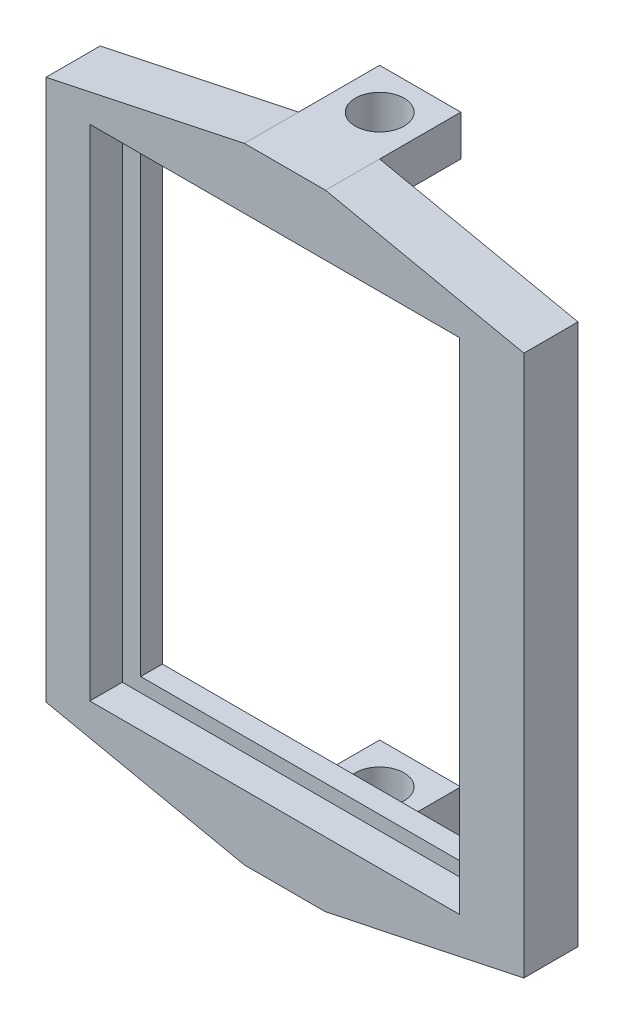
ISO-10303-21;
HEADER;
FILE_DESCRIPTION(('STEP AP214'),'2;1');
FILE_NAME('part.step','',(''),(''),'','','');
FILE_SCHEMA(('AUTOMOTIVE_DESIGN { 1 0 10303 214 1 1 1 1 }'));
ENDSEC;
DATA;
#1=APPLICATION_CONTEXT('core data for automotive mechanical design processes');
#2=APPLICATION_PROTOCOL_DEFINITION('international standard','automotive_design',2000,#1);
#3=PRODUCT_CONTEXT('',#1,'mechanical');
#4=PRODUCT('Part','Part','',(#3));
#5=PRODUCT_RELATED_PRODUCT_CATEGORY('part','',(#4));
#6=PRODUCT_DEFINITION_FORMATION('','',#4);
#7=PRODUCT_DEFINITION_CONTEXT('part definition',#1,'design');
#8=PRODUCT_DEFINITION('design','',#6,#7);
#9=PRODUCT_DEFINITION_SHAPE('','',#8);
#10=(LENGTH_UNIT() NAMED_UNIT(*) SI_UNIT(.MILLI.,.METRE.));
#11=(NAMED_UNIT(*) PLANE_ANGLE_UNIT() SI_UNIT($,.RADIAN.));
#12=(NAMED_UNIT(*) SI_UNIT($,.STERADIAN.) SOLID_ANGLE_UNIT());
#13=UNCERTAINTY_MEASURE_WITH_UNIT(LENGTH_MEASURE(1.E-05),#10,'distance_accuracy_value','');
#14=(GEOMETRIC_REPRESENTATION_CONTEXT(3) GLOBAL_UNCERTAINTY_ASSIGNED_CONTEXT((#13)) GLOBAL_UNIT_ASSIGNED_CONTEXT((#10,
#11,#12)) REPRESENTATION_CONTEXT('',''));
#15=CARTESIAN_POINT('',(0.,0.,0.));
#16=DIRECTION('',(0.,0.,1.));
#17=DIRECTION('',(1.,0.,0.));
#18=AXIS2_PLACEMENT_3D('',#15,#16,#17);
#19=CARTESIAN_POINT('',(10.5819434615359,28.3481904822226,7.5));
#20=DIRECTION('',(1.,0.,0.));
#21=DIRECTION('',(0.,0.,-1.));
#22=AXIS2_PLACEMENT_3D('',#19,#20,#21);
#23=PLANE('',#22);
#24=DIRECTION('',(0.,-1.,0.));
#25=VECTOR('',#24,1.);
#26=CARTESIAN_POINT('',(10.5819434615359,28.3481904822226,0.));
#27=LINE('',#26,#25);
#28=CARTESIAN_POINT('',(10.5819434615359,28.3481904822226,0.));
#29=VERTEX_POINT('',#28);
#30=CARTESIAN_POINT('',(10.5819434615359,24.5981904822226,0.));
#31=VERTEX_POINT('',#30);
#32=EDGE_CURVE('E105',#29,#31,#27,.T.);
#33=ORIENTED_EDGE('',*,*,#32,.F.);
#34=DIRECTION('',(0.,0.,-1.));
#35=VECTOR('',#34,1.);
#36=CARTESIAN_POINT('',(10.5819434615359,28.3481904822226,7.5));
#37=LINE('',#36,#35);
#38=CARTESIAN_POINT('',(10.5819434615359,28.3481904822226,7.5));
#39=VERTEX_POINT('',#38);
#40=EDGE_CURVE('E11',#39,#29,#37,.T.);
#41=ORIENTED_EDGE('',*,*,#40,.F.);
#42=DIRECTION('',(0.,-1.,0.));
#43=VECTOR('',#42,1.);
#44=CARTESIAN_POINT('',(10.5819434615359,28.3481904822226,7.5));
#45=LINE('',#44,#43);
#46=CARTESIAN_POINT('',(10.5819434615359,24.5981904822226,7.5));
#47=VERTEX_POINT('',#46);
#48=EDGE_CURVE('E92',#39,#47,#45,.T.);
#49=ORIENTED_EDGE('',*,*,#48,.T.);
#50=DIRECTION('',(0.,0.,-1.));
#51=VECTOR('',#50,1.);
#52=CARTESIAN_POINT('',(10.5819434615359,24.5981904822226,7.5));
#53=LINE('',#52,#51);
#54=EDGE_CURVE('E109',#47,#31,#53,.T.);
#55=ORIENTED_EDGE('',*,*,#54,.T.);
#56=EDGE_LOOP('',(#33,#41,#49,#55));
#57=FACE_BOUND('',#56,.T.);
#58=ADVANCED_FACE('F39',(#57),#23,.T.);
#59=CARTESIAN_POINT('',(10.5819434615359,28.3481904822226,7.5));
#60=DIRECTION('',(0.,-1.,0.));
#61=DIRECTION('',(0.,0.,-1.));
#62=AXIS2_PLACEMENT_3D('',#59,#60,#61);
#63=PLANE('',#62);
#64=CARTESIAN_POINT('',(6.83194346153586,28.3481904822226,3.75));
#65=DIRECTION('',(0.,1.,0.));
#66=DIRECTION('',(0.,0.,1.));
#67=AXIS2_PLACEMENT_3D('',#64,#65,#66);
#68=CIRCLE('',#67,2.25);
#69=CARTESIAN_POINT('',(6.83194346153586,28.3481904822226,6.));
#70=VERTEX_POINT('',#69);
#71=EDGE_CURVE('E119',#70,#70,#68,.T.);
#72=ORIENTED_EDGE('',*,*,#71,.F.);
#73=EDGE_LOOP('',(#72));
#74=FACE_BOUND('',#73,.T.);
#75=DIRECTION('',(-1.,0.,0.));
#76=VECTOR('',#75,1.);
#77=CARTESIAN_POINT('',(10.5819434615359,28.3481904822226,0.));
#78=LINE('',#77,#76);
#79=CARTESIAN_POINT('',(3.08194346153586,28.3481904822226,0.));
#80=VERTEX_POINT('',#79);
#81=EDGE_CURVE('E81',#29,#80,#78,.T.);
#82=ORIENTED_EDGE('',*,*,#81,.T.);
#83=DIRECTION('',(0.,0.,-1.));
#84=VECTOR('',#83,1.);
#85=CARTESIAN_POINT('',(3.08194346153586,28.3481904822226,7.5));
#86=LINE('',#85,#84);
#87=CARTESIAN_POINT('',(3.08194346153586,28.3481904822226,7.5));
#88=VERTEX_POINT('',#87);
#89=EDGE_CURVE('E47',#88,#80,#86,.T.);
#90=ORIENTED_EDGE('',*,*,#89,.F.);
#91=DIRECTION('',(0.,0.,-1.));
#92=VECTOR('',#91,1.);
#93=CARTESIAN_POINT('',(3.08194346153586,28.3481904822226,9.5));
#94=LINE('',#93,#92);
#95=CARTESIAN_POINT('',(3.08194346153586,28.3481904822226,12.5));
#96=VERTEX_POINT('',#95);
#97=EDGE_CURVE('E127',#96,#88,#94,.T.);
#98=ORIENTED_EDGE('',*,*,#97,.F.);
#99=DIRECTION('',(-1.,0.,0.));
#100=VECTOR('',#99,1.);
#101=CARTESIAN_POINT('',(3.08194346153586,28.3481904822226,12.5));
#102=LINE('',#101,#100);
#103=CARTESIAN_POINT('',(10.5819434615359,28.3481904822226,12.5));
#104=VERTEX_POINT('',#103);
#105=EDGE_CURVE('E147',#104,#96,#102,.T.);
#106=ORIENTED_EDGE('',*,*,#105,.F.);
#107=DIRECTION('',(0.,0.,-1.));
#108=VECTOR('',#107,1.);
#109=CARTESIAN_POINT('',(10.5819434615359,28.3481904822226,9.5));
#110=LINE('',#109,#108);
#111=EDGE_CURVE('E123',#104,#39,#110,.T.);
#112=ORIENTED_EDGE('',*,*,#111,.T.);
#113=ORIENTED_EDGE('',*,*,#40,.T.);
#114=EDGE_LOOP('',(#82,#90,#98,#106,#112,#113));
#115=FACE_BOUND('',#114,.T.);
#116=ADVANCED_FACE('F83',(#74,#115),#63,.F.);
#117=CARTESIAN_POINT('',(3.08194346153586,28.3481904822226,7.5));
#118=DIRECTION('',(1.,0.,0.));
#119=DIRECTION('',(0.,1.,0.));
#120=AXIS2_PLACEMENT_3D('',#117,#118,#119);
#121=PLANE('',#120);
#122=DIRECTION('',(0.,-1.,0.));
#123=VECTOR('',#122,1.);
#124=CARTESIAN_POINT('',(3.08194346153586,28.3481904822226,0.));
#125=LINE('',#124,#123);
#126=CARTESIAN_POINT('',(3.08194346153586,24.5981904822226,0.));
#127=VERTEX_POINT('',#126);
#128=EDGE_CURVE('E93',#80,#127,#125,.T.);
#129=ORIENTED_EDGE('',*,*,#128,.T.);
#130=DIRECTION('',(0.,0.,-1.));
#131=VECTOR('',#130,1.);
#132=CARTESIAN_POINT('',(3.08194346153586,24.5981904822226,7.5));
#133=LINE('',#132,#131);
#134=CARTESIAN_POINT('',(3.08194346153586,24.5981904822226,7.5));
#135=VERTEX_POINT('',#134);
#136=EDGE_CURVE('E99',#135,#127,#133,.T.);
#137=ORIENTED_EDGE('',*,*,#136,.F.);
#138=DIRECTION('',(0.,-1.,0.));
#139=VECTOR('',#138,1.);
#140=CARTESIAN_POINT('',(3.08194346153586,28.3481904822226,7.5));
#141=LINE('',#140,#139);
#142=EDGE_CURVE('E64',#88,#135,#141,.T.);
#143=ORIENTED_EDGE('',*,*,#142,.F.);
#144=ORIENTED_EDGE('',*,*,#89,.T.);
#145=EDGE_LOOP('',(#129,#137,#143,#144));
#146=FACE_BOUND('',#145,.T.);
#147=ADVANCED_FACE('F97',(#146),#121,.F.);
#148=CARTESIAN_POINT('',(10.5819434615359,24.5981904822226,7.5));
#149=DIRECTION('',(0.,-1.,0.));
#150=DIRECTION('',(0.,0.,-1.));
#151=AXIS2_PLACEMENT_3D('',#148,#149,#150);
#152=PLANE('',#151);
#153=CARTESIAN_POINT('',(6.83194346153586,24.5981904822226,3.75));
#154=DIRECTION('',(0.,-1.,0.));
#155=DIRECTION('',(0.,0.,-1.));
#156=AXIS2_PLACEMENT_3D('',#153,#154,#155);
#157=CIRCLE('',#156,2.25);
#158=CARTESIAN_POINT('',(6.83194346153586,24.5981904822226,1.5));
#159=VERTEX_POINT('',#158);
#160=EDGE_CURVE('E42',#159,#159,#157,.T.);
#161=ORIENTED_EDGE('',*,*,#160,.F.);
#162=EDGE_LOOP('',(#161));
#163=FACE_BOUND('',#162,.T.);
#164=DIRECTION('',(-1.,0.,0.));
#165=VECTOR('',#164,1.);
#166=CARTESIAN_POINT('',(10.5819434615359,24.5981904822226,0.));
#167=LINE('',#166,#165);
#168=EDGE_CURVE('E103',#31,#127,#167,.T.);
#169=ORIENTED_EDGE('',*,*,#168,.F.);
#170=ORIENTED_EDGE('',*,*,#54,.F.);
#171=DIRECTION('',(-1.,0.,0.));
#172=VECTOR('',#171,1.);
#173=CARTESIAN_POINT('',(10.5819434615359,24.5981904822226,7.5));
#174=LINE('',#173,#172);
#175=EDGE_CURVE('E113',#47,#135,#174,.T.);
#176=ORIENTED_EDGE('',*,*,#175,.T.);
#177=ORIENTED_EDGE('',*,*,#136,.T.);
#178=EDGE_LOOP('',(#169,#170,#176,#177));
#179=FACE_BOUND('',#178,.T.);
#180=ADVANCED_FACE('F464',(#163,#179),#152,.T.);
#181=CARTESIAN_POINT('',(0.,0.,0.));
#182=DIRECTION('',(0.,0.,-1.));
#183=DIRECTION('',(-1.,0.,0.));
#184=AXIS2_PLACEMENT_3D('',#181,#182,#183);
#185=PLANE('',#184);
#186=ORIENTED_EDGE('',*,*,#32,.T.);
#187=ORIENTED_EDGE('',*,*,#168,.T.);
#188=ORIENTED_EDGE('',*,*,#128,.F.);
#189=ORIENTED_EDGE('',*,*,#81,.F.);
#190=EDGE_LOOP('',(#186,#187,#188,#189));
#191=FACE_BOUND('',#190,.T.);
#192=ADVANCED_FACE('F101',(#191),#185,.T.);
#193=CARTESIAN_POINT('',(6.83194346153586,-29.389582515065,3.75));
#194=DIRECTION('',(0.,1.,0.));
#195=DIRECTION('',(0.,0.,1.));
#196=AXIS2_PLACEMENT_3D('',#193,#194,#195);
#197=CYLINDRICAL_SURFACE('',#196,2.25);
#198=ORIENTED_EDGE('',*,*,#160,.T.);
#199=EDGE_LOOP('',(#198));
#200=FACE_BOUND('',#199,.T.);
#201=ORIENTED_EDGE('',*,*,#71,.T.);
#202=EDGE_LOOP('',(#201));
#203=FACE_BOUND('',#202,.T.);
#204=ADVANCED_FACE('F474',(#200,#203),#197,.F.);
#205=CARTESIAN_POINT('',(0.,0.,7.5));
#206=DIRECTION('',(0.,0.,-1.));
#207=DIRECTION('',(-1.,0.,0.));
#208=AXIS2_PLACEMENT_3D('',#205,#206,#207);
#209=PLANE('',#208);
#210=DIRECTION('',(0.,1.,0.));
#211=VECTOR('',#210,1.);
#212=CARTESIAN_POINT('',(3.0819434615123,-29.389582515065,7.5));
#213=LINE('',#212,#211);
#214=CARTESIAN_POINT('',(3.0819434615123,-29.389582515065,7.5));
#215=VERTEX_POINT('',#214);
#216=CARTESIAN_POINT('',(3.0819434615123,-25.639582515065,7.5));
#217=VERTEX_POINT('',#216);
#218=EDGE_CURVE('E272',#215,#217,#213,.T.);
#219=ORIENTED_EDGE('',*,*,#218,.F.);
#220=DIRECTION('',(0.978443327443816,-0.206515507845474,0.));
#221=VECTOR('',#220,1.);
#222=CARTESIAN_POINT('',(-15.2430565384641,-25.5218095177774,7.5));
#223=LINE('',#222,#221);
#224=CARTESIAN_POINT('',(-15.2430565384641,-25.5218095177774,7.5));
#225=VERTEX_POINT('',#224);
#226=EDGE_CURVE('E168',#225,#215,#223,.T.);
#227=ORIENTED_EDGE('',*,*,#226,.F.);
#228=DIRECTION('',(0.,-1.,0.));
#229=VECTOR('',#228,1.);
#230=CARTESIAN_POINT('',(-15.2430565384641,24.4781904822226,7.5));
#231=LINE('',#230,#229);
#232=CARTESIAN_POINT('',(-15.2430565384641,24.4781904822226,7.5));
#233=VERTEX_POINT('',#232);
#234=EDGE_CURVE('E159',#233,#225,#231,.T.);
#235=ORIENTED_EDGE('',*,*,#234,.F.);
#236=DIRECTION('',(-0.978419294343803,-0.206629340742729,0.));
#237=VECTOR('',#236,1.);
#238=CARTESIAN_POINT('',(-15.2430565384641,24.4781904822226,7.5));
#239=LINE('',#238,#237);
#240=EDGE_CURVE('E155',#88,#233,#239,.T.);
#241=ORIENTED_EDGE('',*,*,#240,.F.);
#242=ORIENTED_EDGE('',*,*,#142,.T.);
#243=ORIENTED_EDGE('',*,*,#175,.F.);
#244=ORIENTED_EDGE('',*,*,#48,.F.);
#245=DIRECTION('',(-0.978419294343695,0.206629340743238,0.));
#246=VECTOR('',#245,1.);
#247=CARTESIAN_POINT('',(10.5819434615359,28.3481904822226,7.5));
#248=LINE('',#247,#246);
#249=CARTESIAN_POINT('',(28.9069434614887,24.4781904822226,7.5));
#250=VERTEX_POINT('',#249);
#251=EDGE_CURVE('E140',#250,#39,#248,.T.);
#252=ORIENTED_EDGE('',*,*,#251,.F.);
#253=DIRECTION('',(0.,1.,0.));
#254=VECTOR('',#253,1.);
#255=CARTESIAN_POINT('',(28.9069434614887,24.4781904822226,7.5));
#256=LINE('',#255,#254);
#257=CARTESIAN_POINT('',(28.9069434614887,-25.5218095177774,7.5));
#258=VERTEX_POINT('',#257);
#259=EDGE_CURVE('E174',#258,#250,#256,.T.);
#260=ORIENTED_EDGE('',*,*,#259,.F.);
#261=DIRECTION('',(0.978443327443816,0.206515507845474,0.));
#262=VECTOR('',#261,1.);
#263=CARTESIAN_POINT('',(10.5819434615123,-29.389582515065,7.5));
#264=LINE('',#263,#262);
#265=CARTESIAN_POINT('',(10.5819434615123,-29.389582515065,7.5));
#266=VERTEX_POINT('',#265);
#267=EDGE_CURVE('E171',#266,#258,#264,.T.);
#268=ORIENTED_EDGE('',*,*,#267,.F.);
#269=DIRECTION('',(0.,1.,0.));
#270=VECTOR('',#269,1.);
#271=CARTESIAN_POINT('',(10.5819434615123,-29.389582515065,7.5));
#272=LINE('',#271,#270);
#273=CARTESIAN_POINT('',(10.5819434615123,-25.639582515065,7.5));
#274=VERTEX_POINT('',#273);
#275=EDGE_CURVE('E258',#266,#274,#272,.T.);
#276=ORIENTED_EDGE('',*,*,#275,.T.);
#277=DIRECTION('',(1.,0.,0.));
#278=VECTOR('',#277,1.);
#279=CARTESIAN_POINT('',(3.0819434615123,-25.639582515065,7.5));
#280=LINE('',#279,#278);
#281=EDGE_CURVE('E284',#217,#274,#280,.T.);
#282=ORIENTED_EDGE('',*,*,#281,.F.);
#283=EDGE_LOOP('',(#219,#227,#235,#241,#242,#243,#244,#252,#260,#268,#276,#282));
#284=FACE_BOUND('',#283,.T.);
#285=DIRECTION('',(0.,1.,0.));
#286=VECTOR('',#285,1.);
#287=CARTESIAN_POINT('',(22.2069434615354,21.2481904822223,7.5));
#288=LINE('',#287,#286);
#289=CARTESIAN_POINT('',(22.2069434615354,-22.1018095177777,7.5));
#290=VERTEX_POINT('',#289);
#291=CARTESIAN_POINT('',(22.2069434615354,21.2481904822223,7.5));
#292=VERTEX_POINT('',#291);
#293=EDGE_CURVE('E295',#290,#292,#288,.T.);
#294=ORIENTED_EDGE('',*,*,#293,.T.);
#295=DIRECTION('',(-1.,0.,0.));
#296=VECTOR('',#295,1.);
#297=CARTESIAN_POINT('',(22.2069434615354,21.2481904822223,7.5));
#298=LINE('',#297,#296);
#299=CARTESIAN_POINT('',(-9.49305653846411,21.2481904822223,7.5));
#300=VERTEX_POINT('',#299);
#301=EDGE_CURVE('E281',#292,#300,#298,.T.);
#302=ORIENTED_EDGE('',*,*,#301,.T.);
#303=DIRECTION('',(0.,-1.,0.));
#304=VECTOR('',#303,1.);
#305=CARTESIAN_POINT('',(-9.49305653846411,21.2481904822223,7.5));
#306=LINE('',#305,#304);
#307=CARTESIAN_POINT('',(-9.49305653846367,-22.1018095177777,7.5));
#308=VERTEX_POINT('',#307);
#309=EDGE_CURVE('E307',#300,#308,#306,.T.);
#310=ORIENTED_EDGE('',*,*,#309,.T.);
#311=DIRECTION('',(1.,0.,0.));
#312=VECTOR('',#311,1.);
#313=CARTESIAN_POINT('',(22.2069434615354,-22.1018095177777,7.5));
#314=LINE('',#313,#312);
#315=EDGE_CURVE('E310',#308,#290,#314,.T.);
#316=ORIENTED_EDGE('',*,*,#315,.T.);
#317=EDGE_LOOP('',(#294,#302,#310,#316));
#318=FACE_BOUND('',#317,.T.);
#319=ADVANCED_FACE('F135',(#284,#318),#209,.T.);
#320=CARTESIAN_POINT('',(0.,0.,9.5));
#321=DIRECTION('',(0.,0.,-1.));
#322=DIRECTION('',(-1.,0.,0.));
#323=AXIS2_PLACEMENT_3D('',#320,#321,#322);
#324=PLANE('',#323);
#325=DIRECTION('',(-1.,0.,0.));
#326=VECTOR('',#325,1.);
#327=CARTESIAN_POINT('',(-11.1930565384647,22.7431904822222,9.5));
#328=LINE('',#327,#326);
#329=CARTESIAN_POINT('',(22.9569434615353,22.7431904822223,9.5));
#330=VERTEX_POINT('',#329);
#331=CARTESIAN_POINT('',(-11.1930565384647,22.7431904822222,9.5));
#332=VERTEX_POINT('',#331);
#333=EDGE_CURVE('E435',#330,#332,#328,.T.);
#334=ORIENTED_EDGE('',*,*,#333,.T.);
#335=DIRECTION('',(0.,-1.,0.));
#336=VECTOR('',#335,1.);
#337=CARTESIAN_POINT('',(-11.1930565384646,-23.4068095177778,9.5));
#338=LINE('',#337,#336);
#339=CARTESIAN_POINT('',(-11.1930565384646,-23.4068095177778,9.5));
#340=VERTEX_POINT('',#339);
#341=EDGE_CURVE('E55',#332,#340,#338,.T.);
#342=ORIENTED_EDGE('',*,*,#341,.T.);
#343=DIRECTION('',(1.,0.,0.));
#344=VECTOR('',#343,1.);
#345=CARTESIAN_POINT('',(-11.1930565384646,-23.4068095177778,9.5));
#346=LINE('',#345,#344);
#347=CARTESIAN_POINT('',(22.9569434615354,-23.4068095177777,9.5));
#348=VERTEX_POINT('',#347);
#349=EDGE_CURVE('E432',#340,#348,#346,.T.);
#350=ORIENTED_EDGE('',*,*,#349,.T.);
#351=DIRECTION('',(0.,1.,0.));
#352=VECTOR('',#351,1.);
#353=CARTESIAN_POINT('',(22.9569434615354,-23.4068095177777,9.5));
#354=LINE('',#353,#352);
#355=EDGE_CURVE('E423',#348,#330,#354,.T.);
#356=ORIENTED_EDGE('',*,*,#355,.T.);
#357=EDGE_LOOP('',(#334,#342,#350,#356));
#358=FACE_BOUND('',#357,.T.);
#359=DIRECTION('',(-1.,0.,0.));
#360=VECTOR('',#359,1.);
#361=CARTESIAN_POINT('',(22.2069434615354,21.2481904822223,9.5));
#362=LINE('',#361,#360);
#363=CARTESIAN_POINT('',(22.2069434615354,21.2481904822223,9.5));
#364=VERTEX_POINT('',#363);
#365=CARTESIAN_POINT('',(-9.49305653846411,21.2481904822223,9.5));
#366=VERTEX_POINT('',#365);
#367=EDGE_CURVE('E291',#364,#366,#362,.T.);
#368=ORIENTED_EDGE('',*,*,#367,.F.);
#369=DIRECTION('',(0.,1.,0.));
#370=VECTOR('',#369,1.);
#371=CARTESIAN_POINT('',(22.2069434615354,21.2481904822223,9.5));
#372=LINE('',#371,#370);
#373=CARTESIAN_POINT('',(22.2069434615354,-22.1018095177777,9.5));
#374=VERTEX_POINT('',#373);
#375=EDGE_CURVE('E301',#374,#364,#372,.T.);
#376=ORIENTED_EDGE('',*,*,#375,.F.);
#377=DIRECTION('',(1.,0.,0.));
#378=VECTOR('',#377,1.);
#379=CARTESIAN_POINT('',(22.2069434615354,-22.1018095177777,9.5));
#380=LINE('',#379,#378);
#381=CARTESIAN_POINT('',(-9.49305653846367,-22.1018095177777,9.5));
#382=VERTEX_POINT('',#381);
#383=EDGE_CURVE('E298',#382,#374,#380,.T.);
#384=ORIENTED_EDGE('',*,*,#383,.F.);
#385=DIRECTION('',(0.,-1.,0.));
#386=VECTOR('',#385,1.);
#387=CARTESIAN_POINT('',(-9.49305653846411,21.2481904822223,9.5));
#388=LINE('',#387,#386);
#389=EDGE_CURVE('E294',#366,#382,#388,.T.);
#390=ORIENTED_EDGE('',*,*,#389,.F.);
#391=EDGE_LOOP('',(#368,#376,#384,#390));
#392=FACE_BOUND('',#391,.T.);
#393=ADVANCED_FACE('F351',(#358,#392),#324,.F.);
#394=CARTESIAN_POINT('',(10.5819434615359,28.3481904822226,9.5));
#395=DIRECTION('',(-0.206629340743238,-0.978419294343695,0.));
#396=DIRECTION('',(0.978419294343696,-0.206629340743238,0.));
#397=AXIS2_PLACEMENT_3D('',#394,#395,#396);
#398=PLANE('',#397);
#399=ORIENTED_EDGE('',*,*,#251,.T.);
#400=ORIENTED_EDGE('',*,*,#111,.F.);
#401=DIRECTION('',(-0.978419294343695,0.206629340743238,0.));
#402=VECTOR('',#401,1.);
#403=CARTESIAN_POINT('',(10.5819434615359,28.3481904822226,12.5));
#404=LINE('',#403,#402);
#405=CARTESIAN_POINT('',(28.9069434614887,24.4781904822226,12.5));
#406=VERTEX_POINT('',#405);
#407=EDGE_CURVE('E247',#406,#104,#404,.T.);
#408=ORIENTED_EDGE('',*,*,#407,.F.);
#409=DIRECTION('',(0.,0.,-1.));
#410=VECTOR('',#409,1.);
#411=CARTESIAN_POINT('',(28.9069434614887,24.4781904822226,9.5));
#412=LINE('',#411,#410);
#413=EDGE_CURVE('E154',#406,#250,#412,.T.);
#414=ORIENTED_EDGE('',*,*,#413,.T.);
#415=EDGE_LOOP('',(#399,#400,#408,#414));
#416=FACE_BOUND('',#415,.T.);
#417=ADVANCED_FACE('F152',(#416),#398,.F.);
#418=CARTESIAN_POINT('',(-15.2430565384641,24.4781904822226,9.5));
#419=DIRECTION('',(0.206629340742729,-0.978419294343803,0.));
#420=DIRECTION('',(0.978419294343803,0.206629340742729,0.));
#421=AXIS2_PLACEMENT_3D('',#418,#419,#420);
#422=PLANE('',#421);
#423=ORIENTED_EDGE('',*,*,#240,.T.);
#424=DIRECTION('',(0.,0.,-1.));
#425=VECTOR('',#424,1.);
#426=CARTESIAN_POINT('',(-15.2430565384641,24.4781904822226,9.5));
#427=LINE('',#426,#425);
#428=CARTESIAN_POINT('',(-15.2430565384641,24.4781904822226,12.5));
#429=VERTEX_POINT('',#428);
#430=EDGE_CURVE('E190',#429,#233,#427,.T.);
#431=ORIENTED_EDGE('',*,*,#430,.F.);
#432=DIRECTION('',(-0.978419294343803,-0.206629340742729,0.));
#433=VECTOR('',#432,1.);
#434=CARTESIAN_POINT('',(-15.2430565384641,24.4781904822226,12.5));
#435=LINE('',#434,#433);
#436=EDGE_CURVE('E200',#96,#429,#435,.T.);
#437=ORIENTED_EDGE('',*,*,#436,.F.);
#438=ORIENTED_EDGE('',*,*,#97,.T.);
#439=EDGE_LOOP('',(#423,#431,#437,#438));
#440=FACE_BOUND('',#439,.T.);
#441=ADVANCED_FACE('F195',(#440),#422,.F.);
#442=CARTESIAN_POINT('',(-15.2430565384641,24.4781904822226,9.5));
#443=DIRECTION('',(1.,0.,0.));
#444=DIRECTION('',(0.,0.,-1.));
#445=AXIS2_PLACEMENT_3D('',#442,#443,#444);
#446=PLANE('',#445);
#447=ORIENTED_EDGE('',*,*,#234,.T.);
#448=DIRECTION('',(0.,0.,-1.));
#449=VECTOR('',#448,1.);
#450=CARTESIAN_POINT('',(-15.2430565384641,-25.5218095177774,9.5));
#451=LINE('',#450,#449);
#452=CARTESIAN_POINT('',(-15.2430565384641,-25.5218095177774,12.5));
#453=VERTEX_POINT('',#452);
#454=EDGE_CURVE('E187',#453,#225,#451,.T.);
#455=ORIENTED_EDGE('',*,*,#454,.F.);
#456=DIRECTION('',(0.,-1.,0.));
#457=VECTOR('',#456,1.);
#458=CARTESIAN_POINT('',(-15.2430565384641,-25.5218095177774,12.5));
#459=LINE('',#458,#457);
#460=EDGE_CURVE('E228',#429,#453,#459,.T.);
#461=ORIENTED_EDGE('',*,*,#460,.F.);
#462=ORIENTED_EDGE('',*,*,#430,.T.);
#463=EDGE_LOOP('',(#447,#455,#461,#462));
#464=FACE_BOUND('',#463,.T.);
#465=ADVANCED_FACE('F208',(#464),#446,.F.);
#466=CARTESIAN_POINT('',(-15.2430565384641,-25.5218095177774,9.5));
#467=DIRECTION('',(0.206515507845474,0.978443327443816,0.));
#468=DIRECTION('',(-0.978443327443816,0.206515507845474,0.));
#469=AXIS2_PLACEMENT_3D('',#466,#467,#468);
#470=PLANE('',#469);
#471=ORIENTED_EDGE('',*,*,#226,.T.);
#472=DIRECTION('',(0.,0.,-1.));
#473=VECTOR('',#472,1.);
#474=CARTESIAN_POINT('',(3.0819434615123,-29.389582515065,9.5));
#475=LINE('',#474,#473);
#476=CARTESIAN_POINT('',(3.0819434615123,-29.389582515065,12.5));
#477=VERTEX_POINT('',#476);
#478=EDGE_CURVE('E184',#477,#215,#475,.T.);
#479=ORIENTED_EDGE('',*,*,#478,.F.);
#480=DIRECTION('',(0.978443327443816,-0.206515507845474,0.));
#481=VECTOR('',#480,1.);
#482=CARTESIAN_POINT('',(3.0819434615123,-29.389582515065,12.5));
#483=LINE('',#482,#481);
#484=EDGE_CURVE('E219',#453,#477,#483,.T.);
#485=ORIENTED_EDGE('',*,*,#484,.F.);
#486=ORIENTED_EDGE('',*,*,#454,.T.);
#487=EDGE_LOOP('',(#471,#479,#485,#486));
#488=FACE_BOUND('',#487,.T.);
#489=ADVANCED_FACE('F215',(#488),#470,.F.);
#490=CARTESIAN_POINT('',(3.0819434615123,-29.389582515065,9.5));
#491=DIRECTION('',(0.,1.,0.));
#492=DIRECTION('',(0.,0.,1.));
#493=AXIS2_PLACEMENT_3D('',#490,#491,#492);
#494=PLANE('',#493);
#495=ORIENTED_EDGE('',*,*,#478,.T.);
#496=DIRECTION('',(0.,0.,-1.));
#497=VECTOR('',#496,1.);
#498=CARTESIAN_POINT('',(3.0819434615123,-29.389582515065,7.5));
#499=LINE('',#498,#497);
#500=CARTESIAN_POINT('',(3.0819434615123,-29.389582515065,0.));
#501=VERTEX_POINT('',#500);
#502=EDGE_CURVE('E265',#215,#501,#499,.T.);
#503=ORIENTED_EDGE('',*,*,#502,.T.);
#504=DIRECTION('',(1.,0.,0.));
#505=VECTOR('',#504,1.);
#506=CARTESIAN_POINT('',(3.0819434615123,-29.389582515065,0.));
#507=LINE('',#506,#505);
#508=CARTESIAN_POINT('',(10.5819434615123,-29.389582515065,0.));
#509=VERTEX_POINT('',#508);
#510=EDGE_CURVE('E268',#501,#509,#507,.T.);
#511=ORIENTED_EDGE('',*,*,#510,.T.);
#512=DIRECTION('',(0.,0.,-1.));
#513=VECTOR('',#512,1.);
#514=CARTESIAN_POINT('',(10.5819434615123,-29.389582515065,7.5));
#515=LINE('',#514,#513);
#516=EDGE_CURVE('E262',#266,#509,#515,.T.);
#517=ORIENTED_EDGE('',*,*,#516,.F.);
#518=DIRECTION('',(0.,0.,-1.));
#519=VECTOR('',#518,1.);
#520=CARTESIAN_POINT('',(10.5819434615123,-29.389582515065,9.5));
#521=LINE('',#520,#519);
#522=CARTESIAN_POINT('',(10.5819434615123,-29.389582515065,12.5));
#523=VERTEX_POINT('',#522);
#524=EDGE_CURVE('E181',#523,#266,#521,.T.);
#525=ORIENTED_EDGE('',*,*,#524,.F.);
#526=DIRECTION('',(1.,0.,0.));
#527=VECTOR('',#526,1.);
#528=CARTESIAN_POINT('',(10.5819434615123,-29.389582515065,12.5));
#529=LINE('',#528,#527);
#530=EDGE_CURVE('E227',#477,#523,#529,.T.);
#531=ORIENTED_EDGE('',*,*,#530,.F.);
#532=EDGE_LOOP('',(#495,#503,#511,#517,#525,#531));
#533=FACE_BOUND('',#532,.T.);
#534=CARTESIAN_POINT('',(6.83194346153586,-29.389582515065,3.75));
#535=DIRECTION('',(0.,1.,0.));
#536=DIRECTION('',(0.,0.,1.));
#537=AXIS2_PLACEMENT_3D('',#534,#535,#536);
#538=CIRCLE('',#537,2.25);
#539=CARTESIAN_POINT('',(6.83194346153586,-29.389582515065,6.));
#540=VERTEX_POINT('',#539);
#541=EDGE_CURVE('E251',#540,#540,#538,.T.);
#542=ORIENTED_EDGE('',*,*,#541,.T.);
#543=EDGE_LOOP('',(#542));
#544=FACE_BOUND('',#543,.T.);
#545=ADVANCED_FACE('F490',(#533,#544),#494,.F.);
#546=CARTESIAN_POINT('',(10.5819434615123,-29.389582515065,9.5));
#547=DIRECTION('',(-0.206515507845474,0.978443327443816,0.));
#548=DIRECTION('',(-0.978443327443816,-0.206515507845474,0.));
#549=AXIS2_PLACEMENT_3D('',#546,#547,#548);
#550=PLANE('',#549);
#551=ORIENTED_EDGE('',*,*,#267,.T.);
#552=DIRECTION('',(0.,0.,-1.));
#553=VECTOR('',#552,1.);
#554=CARTESIAN_POINT('',(28.9069434614887,-25.5218095177774,9.5));
#555=LINE('',#554,#553);
#556=CARTESIAN_POINT('',(28.9069434614887,-25.5218095177774,12.5));
#557=VERTEX_POINT('',#556);
#558=EDGE_CURVE('E178',#557,#258,#555,.T.);
#559=ORIENTED_EDGE('',*,*,#558,.F.);
#560=DIRECTION('',(0.978443327443816,0.206515507845474,0.));
#561=VECTOR('',#560,1.);
#562=CARTESIAN_POINT('',(28.9069434614887,-25.5218095177774,12.5));
#563=LINE('',#562,#561);
#564=EDGE_CURVE('E241',#523,#557,#563,.T.);
#565=ORIENTED_EDGE('',*,*,#564,.F.);
#566=ORIENTED_EDGE('',*,*,#524,.T.);
#567=EDGE_LOOP('',(#551,#559,#565,#566));
#568=FACE_BOUND('',#567,.T.);
#569=ADVANCED_FACE('F493',(#568),#550,.F.);
#570=CARTESIAN_POINT('',(28.9069434614887,24.4781904822226,9.5));
#571=DIRECTION('',(-1.,0.,0.));
#572=DIRECTION('',(0.,0.,1.));
#573=AXIS2_PLACEMENT_3D('',#570,#571,#572);
#574=PLANE('',#573);
#575=ORIENTED_EDGE('',*,*,#259,.T.);
#576=ORIENTED_EDGE('',*,*,#413,.F.);
#577=DIRECTION('',(0.,1.,0.));
#578=VECTOR('',#577,1.);
#579=CARTESIAN_POINT('',(28.9069434614887,24.4781904822226,12.5));
#580=LINE('',#579,#578);
#581=EDGE_CURVE('E244',#557,#406,#580,.T.);
#582=ORIENTED_EDGE('',*,*,#581,.F.);
#583=ORIENTED_EDGE('',*,*,#558,.T.);
#584=EDGE_LOOP('',(#575,#576,#582,#583));
#585=FACE_BOUND('',#584,.T.);
#586=ADVANCED_FACE('F497',(#585),#574,.F.);
#587=CARTESIAN_POINT('',(22.2069434615354,21.2481904822223,9.5));
#588=DIRECTION('',(0.,-1.,0.));
#589=DIRECTION('',(0.,0.,-1.));
#590=AXIS2_PLACEMENT_3D('',#587,#588,#589);
#591=PLANE('',#590);
#592=ORIENTED_EDGE('',*,*,#301,.F.);
#593=DIRECTION('',(0.,0.,-1.));
#594=VECTOR('',#593,1.);
#595=CARTESIAN_POINT('',(22.2069434615354,21.2481904822223,9.5));
#596=LINE('',#595,#594);
#597=EDGE_CURVE('E304',#364,#292,#596,.T.);
#598=ORIENTED_EDGE('',*,*,#597,.F.);
#599=ORIENTED_EDGE('',*,*,#367,.T.);
#600=DIRECTION('',(0.,0.,-1.));
#601=VECTOR('',#600,1.);
#602=CARTESIAN_POINT('',(-9.49305653846411,21.2481904822223,9.5));
#603=LINE('',#602,#601);
#604=EDGE_CURVE('E156',#366,#300,#603,.T.);
#605=ORIENTED_EDGE('',*,*,#604,.T.);
#606=EDGE_LOOP('',(#592,#598,#599,#605));
#607=FACE_BOUND('',#606,.T.);
#608=ADVANCED_FACE('F343',(#607),#591,.T.);
#609=CARTESIAN_POINT('',(-9.49305653846411,21.2481904822223,9.5));
#610=DIRECTION('',(1.,0.,0.));
#611=DIRECTION('',(0.,1.,0.));
#612=AXIS2_PLACEMENT_3D('',#609,#610,#611);
#613=PLANE('',#612);
#614=ORIENTED_EDGE('',*,*,#309,.F.);
#615=ORIENTED_EDGE('',*,*,#604,.F.);
#616=ORIENTED_EDGE('',*,*,#389,.T.);
#617=DIRECTION('',(0.,0.,-1.));
#618=VECTOR('',#617,1.);
#619=CARTESIAN_POINT('',(-9.49305653846367,-22.1018095177777,9.5));
#620=LINE('',#619,#618);
#621=EDGE_CURVE('E162',#382,#308,#620,.T.);
#622=ORIENTED_EDGE('',*,*,#621,.T.);
#623=EDGE_LOOP('',(#614,#615,#616,#622));
#624=FACE_BOUND('',#623,.T.);
#625=ADVANCED_FACE('F325',(#624),#613,.T.);
#626=CARTESIAN_POINT('',(22.2069434615354,-22.1018095177777,9.5));
#627=DIRECTION('',(0.,1.,0.));
#628=DIRECTION('',(0.,0.,1.));
#629=AXIS2_PLACEMENT_3D('',#626,#627,#628);
#630=PLANE('',#629);
#631=ORIENTED_EDGE('',*,*,#315,.F.);
#632=ORIENTED_EDGE('',*,*,#621,.F.);
#633=ORIENTED_EDGE('',*,*,#383,.T.);
#634=DIRECTION('',(0.,0.,-1.));
#635=VECTOR('',#634,1.);
#636=CARTESIAN_POINT('',(22.2069434615354,-22.1018095177777,9.5));
#637=LINE('',#636,#635);
#638=EDGE_CURVE('E317',#374,#290,#637,.T.);
#639=ORIENTED_EDGE('',*,*,#638,.T.);
#640=EDGE_LOOP('',(#631,#632,#633,#639));
#641=FACE_BOUND('',#640,.T.);
#642=ADVANCED_FACE('F334',(#641),#630,.T.);
#643=CARTESIAN_POINT('',(22.2069434615354,21.2481904822223,9.5));
#644=DIRECTION('',(-1.,0.,0.));
#645=DIRECTION('',(0.,0.,1.));
#646=AXIS2_PLACEMENT_3D('',#643,#644,#645);
#647=PLANE('',#646);
#648=ORIENTED_EDGE('',*,*,#293,.F.);
#649=ORIENTED_EDGE('',*,*,#638,.F.);
#650=ORIENTED_EDGE('',*,*,#375,.T.);
#651=ORIENTED_EDGE('',*,*,#597,.T.);
#652=EDGE_LOOP('',(#648,#649,#650,#651));
#653=FACE_BOUND('',#652,.T.);
#654=ADVANCED_FACE('F347',(#653),#647,.T.);
#655=CARTESIAN_POINT('',(3.0819434615123,-29.389582515065,7.5));
#656=DIRECTION('',(-1.,0.,0.));
#657=DIRECTION('',(0.,0.,1.));
#658=AXIS2_PLACEMENT_3D('',#655,#656,#657);
#659=PLANE('',#658);
#660=DIRECTION('',(0.,1.,0.));
#661=VECTOR('',#660,1.);
#662=CARTESIAN_POINT('',(3.0819434615123,-29.389582515065,0.));
#663=LINE('',#662,#661);
#664=CARTESIAN_POINT('',(3.0819434615123,-25.639582515065,0.));
#665=VERTEX_POINT('',#664);
#666=EDGE_CURVE('E278',#501,#665,#663,.T.);
#667=ORIENTED_EDGE('',*,*,#666,.F.);
#668=ORIENTED_EDGE('',*,*,#502,.F.);
#669=ORIENTED_EDGE('',*,*,#218,.T.);
#670=DIRECTION('',(0.,0.,-1.));
#671=VECTOR('',#670,1.);
#672=CARTESIAN_POINT('',(3.0819434615123,-25.639582515065,7.5));
#673=LINE('',#672,#671);
#674=EDGE_CURVE('E255',#217,#665,#673,.T.);
#675=ORIENTED_EDGE('',*,*,#674,.T.);
#676=EDGE_LOOP('',(#667,#668,#669,#675));
#677=FACE_BOUND('',#676,.T.);
#678=ADVANCED_FACE('F511',(#677),#659,.T.);
#679=CARTESIAN_POINT('',(10.5819434615123,-29.389582515065,7.5));
#680=DIRECTION('',(-1.,0.,0.));
#681=DIRECTION('',(0.,0.,1.));
#682=AXIS2_PLACEMENT_3D('',#679,#680,#681);
#683=PLANE('',#682);
#684=DIRECTION('',(0.,1.,0.));
#685=VECTOR('',#684,1.);
#686=CARTESIAN_POINT('',(10.5819434615123,-29.389582515065,0.));
#687=LINE('',#686,#685);
#688=CARTESIAN_POINT('',(10.5819434615123,-25.639582515065,0.));
#689=VERTEX_POINT('',#688);
#690=EDGE_CURVE('E271',#509,#689,#687,.T.);
#691=ORIENTED_EDGE('',*,*,#690,.T.);
#692=DIRECTION('',(0.,0.,-1.));
#693=VECTOR('',#692,1.);
#694=CARTESIAN_POINT('',(10.5819434615123,-25.639582515065,7.5));
#695=LINE('',#694,#693);
#696=EDGE_CURVE('E259',#274,#689,#695,.T.);
#697=ORIENTED_EDGE('',*,*,#696,.F.);
#698=ORIENTED_EDGE('',*,*,#275,.F.);
#699=ORIENTED_EDGE('',*,*,#516,.T.);
#700=EDGE_LOOP('',(#691,#697,#698,#699));
#701=FACE_BOUND('',#700,.T.);
#702=ADVANCED_FACE('F518',(#701),#683,.F.);
#703=CARTESIAN_POINT('',(3.0819434615123,-25.639582515065,7.5));
#704=DIRECTION('',(0.,1.,0.));
#705=DIRECTION('',(0.,0.,1.));
#706=AXIS2_PLACEMENT_3D('',#703,#704,#705);
#707=PLANE('',#706);
#708=CARTESIAN_POINT('',(6.83194346153586,-25.639582515065,3.75));
#709=DIRECTION('',(0.,1.,0.));
#710=DIRECTION('',(0.,0.,1.));
#711=AXIS2_PLACEMENT_3D('',#708,#709,#710);
#712=CIRCLE('',#711,2.25);
#713=CARTESIAN_POINT('',(6.83194346153586,-25.639582515065,6.));
#714=VERTEX_POINT('',#713);
#715=EDGE_CURVE('E254',#714,#714,#712,.T.);
#716=ORIENTED_EDGE('',*,*,#715,.F.);
#717=EDGE_LOOP('',(#716));
#718=FACE_BOUND('',#717,.T.);
#719=DIRECTION('',(1.,0.,0.));
#720=VECTOR('',#719,1.);
#721=CARTESIAN_POINT('',(3.0819434615123,-25.639582515065,0.));
#722=LINE('',#721,#720);
#723=EDGE_CURVE('E275',#665,#689,#722,.T.);
#724=ORIENTED_EDGE('',*,*,#723,.F.);
#725=ORIENTED_EDGE('',*,*,#674,.F.);
#726=ORIENTED_EDGE('',*,*,#281,.T.);
#727=ORIENTED_EDGE('',*,*,#696,.T.);
#728=EDGE_LOOP('',(#724,#725,#726,#727));
#729=FACE_BOUND('',#728,.T.);
#730=ADVANCED_FACE('F516',(#718,#729),#707,.T.);
#731=CARTESIAN_POINT('',(0.,0.,0.));
#732=DIRECTION('',(0.,0.,-1.));
#733=DIRECTION('',(-1.,0.,0.));
#734=AXIS2_PLACEMENT_3D('',#731,#732,#733);
#735=PLANE('',#734);
#736=ORIENTED_EDGE('',*,*,#666,.T.);
#737=ORIENTED_EDGE('',*,*,#723,.T.);
#738=ORIENTED_EDGE('',*,*,#690,.F.);
#739=ORIENTED_EDGE('',*,*,#510,.F.);
#740=EDGE_LOOP('',(#736,#737,#738,#739));
#741=FACE_BOUND('',#740,.T.);
#742=ADVANCED_FACE('F512',(#741),#735,.T.);
#743=CARTESIAN_POINT('',(6.83194346153586,-29.389582515065,3.75));
#744=DIRECTION('',(0.,1.,0.));
#745=DIRECTION('',(0.,0.,1.));
#746=AXIS2_PLACEMENT_3D('',#743,#744,#745);
#747=CYLINDRICAL_SURFACE('',#746,2.25);
#748=ORIENTED_EDGE('',*,*,#715,.T.);
#749=EDGE_LOOP('',(#748));
#750=FACE_BOUND('',#749,.T.);
#751=ORIENTED_EDGE('',*,*,#541,.F.);
#752=EDGE_LOOP('',(#751));
#753=FACE_BOUND('',#752,.T.);
#754=ADVANCED_FACE('F515',(#750,#753),#747,.F.);
#755=CARTESIAN_POINT('',(0.,0.,12.5));
#756=DIRECTION('',(0.,0.,-1.));
#757=DIRECTION('',(-1.,0.,0.));
#758=AXIS2_PLACEMENT_3D('',#755,#756,#757);
#759=PLANE('',#758);
#760=ORIENTED_EDGE('',*,*,#460,.T.);
#761=ORIENTED_EDGE('',*,*,#484,.T.);
#762=ORIENTED_EDGE('',*,*,#530,.T.);
#763=ORIENTED_EDGE('',*,*,#564,.T.);
#764=ORIENTED_EDGE('',*,*,#581,.T.);
#765=ORIENTED_EDGE('',*,*,#407,.T.);
#766=ORIENTED_EDGE('',*,*,#105,.T.);
#767=ORIENTED_EDGE('',*,*,#436,.T.);
#768=EDGE_LOOP('',(#760,#761,#762,#763,#764,#765,#766,#767));
#769=FACE_BOUND('',#768,.T.);
#770=DIRECTION('',(1.,0.,0.));
#771=VECTOR('',#770,1.);
#772=CARTESIAN_POINT('',(-11.1930565384646,-23.4068095177778,12.5));
#773=LINE('',#772,#771);
#774=CARTESIAN_POINT('',(-11.1930565384646,-23.4068095177778,12.5));
#775=VERTEX_POINT('',#774);
#776=CARTESIAN_POINT('',(22.9569434615354,-23.4068095177777,12.5));
#777=VERTEX_POINT('',#776);
#778=EDGE_CURVE('E410',#775,#777,#773,.T.);
#779=ORIENTED_EDGE('',*,*,#778,.F.);
#780=DIRECTION('',(0.,-1.,0.));
#781=VECTOR('',#780,1.);
#782=CARTESIAN_POINT('',(-11.1930565384646,-23.4068095177778,12.5));
#783=LINE('',#782,#781);
#784=CARTESIAN_POINT('',(-11.1930565384647,22.7431904822222,12.5));
#785=VERTEX_POINT('',#784);
#786=EDGE_CURVE('E428',#785,#775,#783,.T.);
#787=ORIENTED_EDGE('',*,*,#786,.F.);
#788=DIRECTION('',(-1.,0.,0.));
#789=VECTOR('',#788,1.);
#790=CARTESIAN_POINT('',(-11.1930565384647,22.7431904822222,12.5));
#791=LINE('',#790,#789);
#792=CARTESIAN_POINT('',(22.9569434615353,22.7431904822223,12.5));
#793=VERTEX_POINT('',#792);
#794=EDGE_CURVE('E426',#793,#785,#791,.T.);
#795=ORIENTED_EDGE('',*,*,#794,.F.);
#796=DIRECTION('',(0.,1.,0.));
#797=VECTOR('',#796,1.);
#798=CARTESIAN_POINT('',(22.9569434615354,-23.4068095177777,12.5));
#799=LINE('',#798,#797);
#800=EDGE_CURVE('E417',#777,#793,#799,.T.);
#801=ORIENTED_EDGE('',*,*,#800,.F.);
#802=EDGE_LOOP('',(#779,#787,#795,#801));
#803=FACE_BOUND('',#802,.T.);
#804=ADVANCED_FACE('F230',(#769,#803),#759,.F.);
#805=CARTESIAN_POINT('',(-11.1930565384646,-23.4068095177778,12.5));
#806=DIRECTION('',(0.,1.,0.));
#807=DIRECTION('',(-1.,0.,0.));
#808=AXIS2_PLACEMENT_3D('',#805,#806,#807);
#809=PLANE('',#808);
#810=ORIENTED_EDGE('',*,*,#349,.F.);
#811=DIRECTION('',(0.,0.,-1.));
#812=VECTOR('',#811,1.);
#813=CARTESIAN_POINT('',(-11.1930565384646,-23.4068095177778,12.5));
#814=LINE('',#813,#812);
#815=EDGE_CURVE('E414',#775,#340,#814,.T.);
#816=ORIENTED_EDGE('',*,*,#815,.F.);
#817=ORIENTED_EDGE('',*,*,#778,.T.);
#818=DIRECTION('',(0.,0.,-1.));
#819=VECTOR('',#818,1.);
#820=CARTESIAN_POINT('',(22.9569434615354,-23.4068095177777,12.5));
#821=LINE('',#820,#819);
#822=EDGE_CURVE('E233',#777,#348,#821,.T.);
#823=ORIENTED_EDGE('',*,*,#822,.T.);
#824=EDGE_LOOP('',(#810,#816,#817,#823));
#825=FACE_BOUND('',#824,.T.);
#826=ADVANCED_FACE('F412',(#825),#809,.T.);
#827=CARTESIAN_POINT('',(22.9569434615354,-23.4068095177777,12.5));
#828=DIRECTION('',(-1.,0.,0.));
#829=DIRECTION('',(0.,-1.,0.));
#830=AXIS2_PLACEMENT_3D('',#827,#828,#829);
#831=PLANE('',#830);
#832=ORIENTED_EDGE('',*,*,#355,.F.);
#833=ORIENTED_EDGE('',*,*,#822,.F.);
#834=ORIENTED_EDGE('',*,*,#800,.T.);
#835=DIRECTION('',(0.,0.,-1.));
#836=VECTOR('',#835,1.);
#837=CARTESIAN_POINT('',(22.9569434615353,22.7431904822223,12.5));
#838=LINE('',#837,#836);
#839=EDGE_CURVE('E236',#793,#330,#838,.T.);
#840=ORIENTED_EDGE('',*,*,#839,.T.);
#841=EDGE_LOOP('',(#832,#833,#834,#840));
#842=FACE_BOUND('',#841,.T.);
#843=ADVANCED_FACE('F420',(#842),#831,.T.);
#844=CARTESIAN_POINT('',(-11.1930565384647,22.7431904822222,12.5));
#845=DIRECTION('',(0.,-1.,0.));
#846=DIRECTION('',(1.,0.,0.));
#847=AXIS2_PLACEMENT_3D('',#844,#845,#846);
#848=PLANE('',#847);
#849=ORIENTED_EDGE('',*,*,#333,.F.);
#850=ORIENTED_EDGE('',*,*,#839,.F.);
#851=ORIENTED_EDGE('',*,*,#794,.T.);
#852=DIRECTION('',(0.,0.,-1.));
#853=VECTOR('',#852,1.);
#854=CARTESIAN_POINT('',(-11.1930565384647,22.7431904822222,12.5));
#855=LINE('',#854,#853);
#856=EDGE_CURVE('E440',#785,#332,#855,.T.);
#857=ORIENTED_EDGE('',*,*,#856,.T.);
#858=EDGE_LOOP('',(#849,#850,#851,#857));
#859=FACE_BOUND('',#858,.T.);
#860=ADVANCED_FACE('F443',(#859),#848,.T.);
#861=CARTESIAN_POINT('',(-11.1930565384646,-23.4068095177778,12.5));
#862=DIRECTION('',(1.,0.,0.));
#863=DIRECTION('',(0.,1.,0.));
#864=AXIS2_PLACEMENT_3D('',#861,#862,#863);
#865=PLANE('',#864);
#866=ORIENTED_EDGE('',*,*,#341,.F.);
#867=ORIENTED_EDGE('',*,*,#856,.F.);
#868=ORIENTED_EDGE('',*,*,#786,.T.);
#869=ORIENTED_EDGE('',*,*,#815,.T.);
#870=EDGE_LOOP('',(#866,#867,#868,#869));
#871=FACE_BOUND('',#870,.T.);
#872=ADVANCED_FACE('F445',(#871),#865,.T.);
#873=CLOSED_SHELL('',(#58,#116,#147,#180,#192,#204,#319,#393,#417,#441,#465,#489,#545,#569,#586,
#608,#625,#642,#654,#678,#702,#730,#742,#754,#804,#826,#843,#860,#872));
#874=MANIFOLD_SOLID_BREP('B2',#873);
#875=ADVANCED_BREP_SHAPE_REPRESENTATION('',(#18,#874),#14);
#876=SHAPE_DEFINITION_REPRESENTATION(#9,#875);
ENDSEC;
END-ISO-10303-21;
